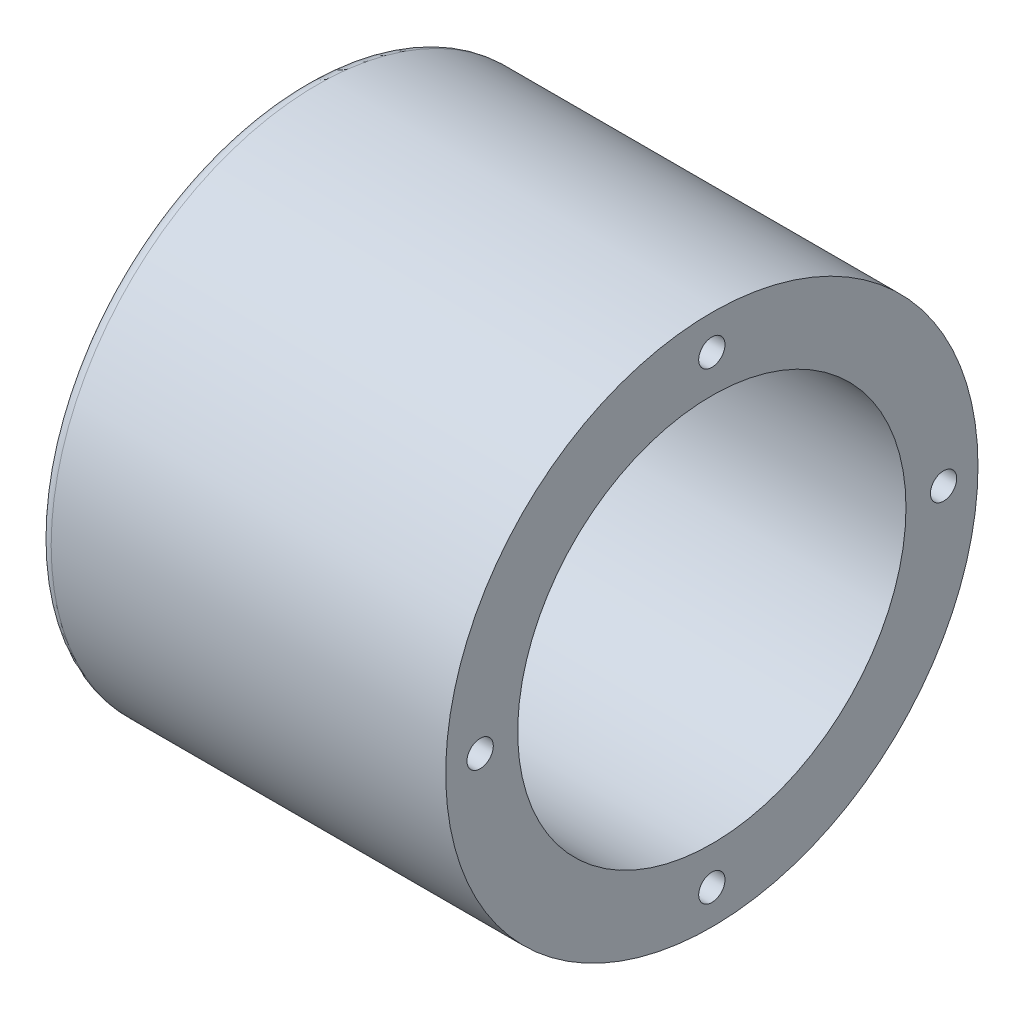
ISO-10303-21;
HEADER;
FILE_DESCRIPTION(('STEP AP214'),'2;1');
FILE_NAME('part.step','',(''),(''),'','','');
FILE_SCHEMA(('AUTOMOTIVE_DESIGN { 1 0 10303 214 1 1 1 1 }'));
ENDSEC;
DATA;
#1=APPLICATION_CONTEXT('core data for automotive mechanical design processes');
#2=APPLICATION_PROTOCOL_DEFINITION('international standard','automotive_design',2000,#1);
#3=PRODUCT_CONTEXT('',#1,'mechanical');
#4=PRODUCT('Part','Part','',(#3));
#5=PRODUCT_RELATED_PRODUCT_CATEGORY('part','',(#4));
#6=PRODUCT_DEFINITION_FORMATION('','',#4);
#7=PRODUCT_DEFINITION_CONTEXT('part definition',#1,'design');
#8=PRODUCT_DEFINITION('design','',#6,#7);
#9=PRODUCT_DEFINITION_SHAPE('','',#8);
#10=(LENGTH_UNIT() NAMED_UNIT(*) SI_UNIT(.MILLI.,.METRE.));
#11=(NAMED_UNIT(*) PLANE_ANGLE_UNIT() SI_UNIT($,.RADIAN.));
#12=(NAMED_UNIT(*) SI_UNIT($,.STERADIAN.) SOLID_ANGLE_UNIT());
#13=UNCERTAINTY_MEASURE_WITH_UNIT(LENGTH_MEASURE(1.E-05),#10,'distance_accuracy_value','');
#14=(GEOMETRIC_REPRESENTATION_CONTEXT(3) GLOBAL_UNCERTAINTY_ASSIGNED_CONTEXT((#13)) GLOBAL_UNIT_ASSIGNED_CONTEXT((#10,
#11,#12)) REPRESENTATION_CONTEXT('',''));
#15=CARTESIAN_POINT('',(0.,0.,0.));
#16=DIRECTION('',(0.,0.,1.));
#17=DIRECTION('',(1.,0.,0.));
#18=AXIS2_PLACEMENT_3D('',#15,#16,#17);
#19=CARTESIAN_POINT('',(-32.5,42.5,0.));
#20=DIRECTION('',(-1.,0.,0.));
#21=DIRECTION('',(0.,0.,1.));
#22=AXIS2_PLACEMENT_3D('',#19,#20,#21);
#23=PLANE('',#22);
#24=CARTESIAN_POINT('',(-32.5,0.,0.));
#25=DIRECTION('',(-1.,0.,0.));
#26=DIRECTION('',(0.,0.,1.));
#27=AXIS2_PLACEMENT_3D('',#24,#25,#26);
#28=CIRCLE('',#27,29.5);
#29=CARTESIAN_POINT('',(-32.5,0.,29.5));
#30=VERTEX_POINT('',#29);
#31=EDGE_CURVE('E51',#30,#30,#28,.F.);
#32=ORIENTED_EDGE('',*,*,#31,.T.);
#33=EDGE_LOOP('',(#32));
#34=FACE_BOUND('',#33,.T.);
#35=CARTESIAN_POINT('',(-32.5,0.,0.));
#36=DIRECTION('',(-1.,0.,0.));
#37=DIRECTION('',(0.,0.,1.));
#38=AXIS2_PLACEMENT_3D('',#35,#36,#37);
#39=CIRCLE('',#38,40.5);
#40=CARTESIAN_POINT('',(-32.5,0.,40.5));
#41=VERTEX_POINT('',#40);
#42=EDGE_CURVE('E125',#41,#41,#39,.T.);
#43=ORIENTED_EDGE('',*,*,#42,.T.);
#44=EDGE_LOOP('',(#43));
#45=FACE_BOUND('',#44,.T.);
#46=ADVANCED_FACE('F41',(#34,#45),#23,.T.);
#47=CARTESIAN_POINT('',(88.99,0.,0.));
#48=DIRECTION('',(1.,0.,0.));
#49=DIRECTION('',(0.,0.,-1.));
#50=AXIS2_PLACEMENT_3D('',#47,#48,#49);
#51=CYLINDRICAL_SURFACE('',#50,28.5);
#52=CARTESIAN_POINT('',(-31.5,0.,0.));
#53=DIRECTION('',(-1.,0.,0.));
#54=DIRECTION('',(0.,0.,1.));
#55=AXIS2_PLACEMENT_3D('',#52,#53,#54);
#56=CIRCLE('',#55,28.5);
#57=CARTESIAN_POINT('',(-31.5,0.,28.5));
#58=VERTEX_POINT('',#57);
#59=EDGE_CURVE('E11',#58,#58,#56,.T.);
#60=ORIENTED_EDGE('',*,*,#59,.T.);
#61=EDGE_LOOP('',(#60));
#62=FACE_BOUND('',#61,.T.);
#63=CARTESIAN_POINT('',(-28.5,0.,0.));
#64=DIRECTION('',(1.,0.,0.));
#65=DIRECTION('',(0.,0.,-1.));
#66=AXIS2_PLACEMENT_3D('',#63,#64,#65);
#67=CIRCLE('',#66,28.5);
#68=CARTESIAN_POINT('',(-28.5,0.,-28.5));
#69=VERTEX_POINT('',#68);
#70=EDGE_CURVE('E117',#69,#69,#67,.T.);
#71=ORIENTED_EDGE('',*,*,#70,.T.);
#72=EDGE_LOOP('',(#71));
#73=FACE_BOUND('',#72,.T.);
#74=ADVANCED_FACE('F148',(#62,#73),#51,.F.);
#75=CARTESIAN_POINT('',(-28.5,31.,0.));
#76=DIRECTION('',(1.,0.,0.));
#77=DIRECTION('',(0.,0.,-1.));
#78=AXIS2_PLACEMENT_3D('',#75,#76,#77);
#79=PLANE('',#78);
#80=CARTESIAN_POINT('',(-28.5,0.,0.));
#81=DIRECTION('',(1.,0.,0.));
#82=DIRECTION('',(0.,0.,-1.));
#83=AXIS2_PLACEMENT_3D('',#80,#81,#82);
#84=CIRCLE('',#83,31.);
#85=CARTESIAN_POINT('',(-28.5,0.,-31.));
#86=VERTEX_POINT('',#85);
#87=EDGE_CURVE('E113',#86,#86,#84,.T.);
#88=ORIENTED_EDGE('',*,*,#87,.T.);
#89=EDGE_LOOP('',(#88));
#90=FACE_BOUND('',#89,.T.);
#91=ORIENTED_EDGE('',*,*,#70,.F.);
#92=EDGE_LOOP('',(#91));
#93=FACE_BOUND('',#92,.T.);
#94=ADVANCED_FACE('F153',(#90,#93),#79,.T.);
#95=CARTESIAN_POINT('',(88.99,0.,0.));
#96=DIRECTION('',(1.,0.,0.));
#97=DIRECTION('',(0.,0.,-1.));
#98=AXIS2_PLACEMENT_3D('',#95,#96,#97);
#99=CYLINDRICAL_SURFACE('',#98,31.);
#100=CARTESIAN_POINT('',(32.5,0.,0.));
#101=DIRECTION('',(1.,0.,0.));
#102=DIRECTION('',(0.,0.,-1.));
#103=AXIS2_PLACEMENT_3D('',#100,#101,#102);
#104=CIRCLE('',#103,31.);
#105=CARTESIAN_POINT('',(32.5,0.,-31.));
#106=VERTEX_POINT('',#105);
#107=EDGE_CURVE('E109',#106,#106,#104,.T.);
#108=ORIENTED_EDGE('',*,*,#107,.T.);
#109=EDGE_LOOP('',(#108));
#110=FACE_BOUND('',#109,.T.);
#111=ORIENTED_EDGE('',*,*,#87,.F.);
#112=EDGE_LOOP('',(#111));
#113=FACE_BOUND('',#112,.T.);
#114=ADVANCED_FACE('F159',(#110,#113),#99,.F.);
#115=CARTESIAN_POINT('',(32.5,42.5,0.));
#116=DIRECTION('',(1.,0.,0.));
#117=DIRECTION('',(0.,0.,-1.));
#118=AXIS2_PLACEMENT_3D('',#115,#116,#117);
#119=PLANE('',#118);
#120=CARTESIAN_POINT('',(32.5,3.87554428611588E-13,37.));
#121=DIRECTION('',(1.,0.,0.));
#122=DIRECTION('',(0.,0.,-1.));
#123=AXIS2_PLACEMENT_3D('',#120,#121,#122);
#124=CIRCLE('',#123,2.09999999999999);
#125=CARTESIAN_POINT('',(32.5,3.87554428611588E-13,34.9));
#126=VERTEX_POINT('',#125);
#127=EDGE_CURVE('E76',#126,#126,#124,.T.);
#128=ORIENTED_EDGE('',*,*,#127,.F.);
#129=EDGE_LOOP('',(#128));
#130=FACE_BOUND('',#129,.T.);
#131=CARTESIAN_POINT('',(32.5,-37.,0.));
#132=DIRECTION('',(1.,0.,0.));
#133=DIRECTION('',(0.,0.,-1.));
#134=AXIS2_PLACEMENT_3D('',#131,#132,#133);
#135=CIRCLE('',#134,2.09999999999999);
#136=CARTESIAN_POINT('',(32.5,-37.,-2.09999999999999));
#137=VERTEX_POINT('',#136);
#138=EDGE_CURVE('E75',#137,#137,#135,.T.);
#139=ORIENTED_EDGE('',*,*,#138,.F.);
#140=EDGE_LOOP('',(#139));
#141=FACE_BOUND('',#140,.T.);
#142=CARTESIAN_POINT('',(32.5,-1.29184809537196E-13,-37.));
#143=DIRECTION('',(1.,0.,0.));
#144=DIRECTION('',(0.,0.,-1.));
#145=AXIS2_PLACEMENT_3D('',#142,#143,#144);
#146=CIRCLE('',#145,2.09999999999999);
#147=CARTESIAN_POINT('',(32.5,-1.29184809537196E-13,-39.1));
#148=VERTEX_POINT('',#147);
#149=EDGE_CURVE('E89',#148,#148,#146,.T.);
#150=ORIENTED_EDGE('',*,*,#149,.F.);
#151=EDGE_LOOP('',(#150));
#152=FACE_BOUND('',#151,.T.);
#153=CARTESIAN_POINT('',(32.5,37.,0.));
#154=DIRECTION('',(1.,0.,0.));
#155=DIRECTION('',(0.,0.,-1.));
#156=AXIS2_PLACEMENT_3D('',#153,#154,#155);
#157=CIRCLE('',#156,2.09999999999999);
#158=CARTESIAN_POINT('',(32.5,37.,-2.09999999999999));
#159=VERTEX_POINT('',#158);
#160=EDGE_CURVE('E97',#159,#159,#157,.T.);
#161=ORIENTED_EDGE('',*,*,#160,.F.);
#162=EDGE_LOOP('',(#161));
#163=FACE_BOUND('',#162,.T.);
#164=CARTESIAN_POINT('',(32.5,0.,0.));
#165=DIRECTION('',(1.,0.,0.));
#166=DIRECTION('',(0.,0.,-1.));
#167=AXIS2_PLACEMENT_3D('',#164,#165,#166);
#168=CIRCLE('',#167,42.5);
#169=CARTESIAN_POINT('',(32.5,0.,-42.5));
#170=VERTEX_POINT('',#169);
#171=EDGE_CURVE('E105',#170,#170,#168,.T.);
#172=ORIENTED_EDGE('',*,*,#171,.T.);
#173=EDGE_LOOP('',(#172));
#174=FACE_BOUND('',#173,.T.);
#175=ORIENTED_EDGE('',*,*,#107,.F.);
#176=EDGE_LOOP('',(#175));
#177=FACE_BOUND('',#176,.T.);
#178=ADVANCED_FACE('F163',(#130,#141,#152,#163,#174,#177),#119,.T.);
#179=CARTESIAN_POINT('',(88.99,0.,0.));
#180=DIRECTION('',(1.,0.,0.));
#181=DIRECTION('',(0.,0.,-1.));
#182=AXIS2_PLACEMENT_3D('',#179,#180,#181);
#183=CYLINDRICAL_SURFACE('',#182,42.5);
#184=CARTESIAN_POINT('',(-30.5,0.,0.));
#185=DIRECTION('',(-1.,0.,0.));
#186=DIRECTION('',(0.,0.,1.));
#187=AXIS2_PLACEMENT_3D('',#184,#185,#186);
#188=CIRCLE('',#187,42.5);
#189=CARTESIAN_POINT('',(-30.5,0.,42.5));
#190=VERTEX_POINT('',#189);
#191=EDGE_CURVE('E121',#190,#190,#188,.F.);
#192=ORIENTED_EDGE('',*,*,#191,.T.);
#193=EDGE_LOOP('',(#192));
#194=FACE_BOUND('',#193,.T.);
#195=ORIENTED_EDGE('',*,*,#171,.F.);
#196=EDGE_LOOP('',(#195));
#197=FACE_BOUND('',#196,.T.);
#198=ADVANCED_FACE('F144',(#194,#197),#183,.T.);
#199=CARTESIAN_POINT('',(-30.5,0.,0.));
#200=DIRECTION('',(-1.,0.,0.));
#201=DIRECTION('',(0.,0.,1.));
#202=AXIS2_PLACEMENT_3D('',#199,#200,#201);
#203=TOROIDAL_SURFACE('',#202,40.5,2.);
#204=ORIENTED_EDGE('',*,*,#42,.F.);
#205=EDGE_LOOP('',(#204));
#206=FACE_BOUND('',#205,.T.);
#207=ORIENTED_EDGE('',*,*,#191,.F.);
#208=EDGE_LOOP('',(#207));
#209=FACE_BOUND('',#208,.T.);
#210=ADVANCED_FACE('F136',(#206,#209),#203,.T.);
#211=CARTESIAN_POINT('',(-32.5,0.,0.));
#212=DIRECTION('',(-1.,0.,0.));
#213=DIRECTION('',(0.,0.,1.));
#214=AXIS2_PLACEMENT_3D('',#211,#212,#213);
#215=CONICAL_SURFACE('',#214,29.5,0.785398163397447);
#216=ORIENTED_EDGE('',*,*,#59,.F.);
#217=EDGE_LOOP('',(#216));
#218=FACE_BOUND('',#217,.T.);
#219=ORIENTED_EDGE('',*,*,#31,.F.);
#220=EDGE_LOOP('',(#219));
#221=FACE_BOUND('',#220,.T.);
#222=ADVANCED_FACE('F44',(#218,#221),#215,.F.);
#223=CARTESIAN_POINT('',(12.5,37.,0.));
#224=DIRECTION('',(1.,0.,0.));
#225=DIRECTION('',(0.,0.,-1.));
#226=AXIS2_PLACEMENT_3D('',#223,#224,#225);
#227=CONICAL_SURFACE('',#226,2.1,1.02974425867665);
#228=CARTESIAN_POINT('',(11.2381927000421,37.,0.));
#229=VERTEX_POINT('',#228);
#230=VERTEX_LOOP('',#229);
#231=FACE_BOUND('',#230,.T.);
#232=CARTESIAN_POINT('',(12.5,37.,0.));
#233=DIRECTION('',(1.,0.,0.));
#234=DIRECTION('',(0.,0.,-1.));
#235=AXIS2_PLACEMENT_3D('',#232,#233,#234);
#236=CIRCLE('',#235,2.1);
#237=CARTESIAN_POINT('',(12.5,37.,-2.1));
#238=VERTEX_POINT('',#237);
#239=EDGE_CURVE('E101',#238,#238,#236,.T.);
#240=ORIENTED_EDGE('',*,*,#239,.T.);
#241=EDGE_LOOP('',(#240));
#242=FACE_BOUND('',#241,.T.);
#243=ADVANCED_FACE('F135',(#231,#242),#227,.F.);
#244=CARTESIAN_POINT('',(32.5,37.,0.));
#245=DIRECTION('',(1.,0.,0.));
#246=DIRECTION('',(0.,0.,-1.));
#247=AXIS2_PLACEMENT_3D('',#244,#245,#246);
#248=CYLINDRICAL_SURFACE('',#247,2.09999999999999);
#249=ORIENTED_EDGE('',*,*,#239,.F.);
#250=EDGE_LOOP('',(#249));
#251=FACE_BOUND('',#250,.T.);
#252=ORIENTED_EDGE('',*,*,#160,.T.);
#253=EDGE_LOOP('',(#252));
#254=FACE_BOUND('',#253,.T.);
#255=ADVANCED_FACE('F142',(#251,#254),#248,.F.);
#256=CARTESIAN_POINT('',(12.5,-1.29184809537196E-13,-37.));
#257=DIRECTION('',(1.,0.,0.));
#258=DIRECTION('',(0.,0.,-1.));
#259=AXIS2_PLACEMENT_3D('',#256,#257,#258);
#260=CONICAL_SURFACE('',#259,2.09999999999999,1.02974425867665);
#261=CARTESIAN_POINT('',(11.2381927000421,-1.34392450387992E-13,-37.));
#262=VERTEX_POINT('',#261);
#263=VERTEX_LOOP('',#262);
#264=FACE_BOUND('',#263,.T.);
#265=CARTESIAN_POINT('',(12.5,-1.29184809537196E-13,-37.));
#266=DIRECTION('',(1.,0.,0.));
#267=DIRECTION('',(0.,0.,-1.));
#268=AXIS2_PLACEMENT_3D('',#265,#266,#267);
#269=CIRCLE('',#268,2.09999999999999);
#270=CARTESIAN_POINT('',(12.5,-1.29184809537196E-13,-39.1));
#271=VERTEX_POINT('',#270);
#272=EDGE_CURVE('E93',#271,#271,#269,.T.);
#273=ORIENTED_EDGE('',*,*,#272,.T.);
#274=EDGE_LOOP('',(#273));
#275=FACE_BOUND('',#274,.T.);
#276=ADVANCED_FACE('F173',(#264,#275),#260,.F.);
#277=CARTESIAN_POINT('',(32.5,-1.29184809537196E-13,-37.));
#278=DIRECTION('',(1.,0.,0.));
#279=DIRECTION('',(0.,0.,-1.));
#280=AXIS2_PLACEMENT_3D('',#277,#278,#279);
#281=CYLINDRICAL_SURFACE('',#280,2.09999999999999);
#282=ORIENTED_EDGE('',*,*,#272,.F.);
#283=EDGE_LOOP('',(#282));
#284=FACE_BOUND('',#283,.T.);
#285=ORIENTED_EDGE('',*,*,#149,.T.);
#286=EDGE_LOOP('',(#285));
#287=FACE_BOUND('',#286,.T.);
#288=ADVANCED_FACE('F177',(#284,#287),#281,.F.);
#289=CARTESIAN_POINT('',(12.5,-37.,0.));
#290=DIRECTION('',(1.,0.,0.));
#291=DIRECTION('',(0.,0.,-1.));
#292=AXIS2_PLACEMENT_3D('',#289,#290,#291);
#293=CONICAL_SURFACE('',#292,2.1,1.02974425867665);
#294=CARTESIAN_POINT('',(11.2381927000421,-37.,0.));
#295=VERTEX_POINT('',#294);
#296=VERTEX_LOOP('',#295);
#297=FACE_BOUND('',#296,.T.);
#298=CARTESIAN_POINT('',(12.5,-37.,0.));
#299=DIRECTION('',(1.,0.,0.));
#300=DIRECTION('',(0.,0.,-1.));
#301=AXIS2_PLACEMENT_3D('',#298,#299,#300);
#302=CIRCLE('',#301,2.1);
#303=CARTESIAN_POINT('',(12.5,-37.,-2.1));
#304=VERTEX_POINT('',#303);
#305=EDGE_CURVE('E81',#304,#304,#302,.T.);
#306=ORIENTED_EDGE('',*,*,#305,.T.);
#307=EDGE_LOOP('',(#306));
#308=FACE_BOUND('',#307,.T.);
#309=ADVANCED_FACE('F180',(#297,#308),#293,.F.);
#310=CARTESIAN_POINT('',(32.5,-37.,0.));
#311=DIRECTION('',(1.,0.,0.));
#312=DIRECTION('',(0.,0.,-1.));
#313=AXIS2_PLACEMENT_3D('',#310,#311,#312);
#314=CYLINDRICAL_SURFACE('',#313,2.09999999999999);
#315=ORIENTED_EDGE('',*,*,#305,.F.);
#316=EDGE_LOOP('',(#315));
#317=FACE_BOUND('',#316,.T.);
#318=ORIENTED_EDGE('',*,*,#138,.T.);
#319=EDGE_LOOP('',(#318));
#320=FACE_BOUND('',#319,.T.);
#321=ADVANCED_FACE('F68',(#317,#320),#314,.F.);
#322=CARTESIAN_POINT('',(12.5,3.87554428611588E-13,37.));
#323=DIRECTION('',(1.,0.,0.));
#324=DIRECTION('',(0.,0.,-1.));
#325=AXIS2_PLACEMENT_3D('',#322,#323,#324);
#326=CONICAL_SURFACE('',#325,2.09999999999999,1.02974425867665);
#327=CARTESIAN_POINT('',(11.2381927000421,3.82346787760792E-13,37.));
#328=VERTEX_POINT('',#327);
#329=VERTEX_LOOP('',#328);
#330=FACE_BOUND('',#329,.T.);
#331=CARTESIAN_POINT('',(12.5,3.87554428611588E-13,37.));
#332=DIRECTION('',(1.,0.,0.));
#333=DIRECTION('',(0.,0.,-1.));
#334=AXIS2_PLACEMENT_3D('',#331,#332,#333);
#335=CIRCLE('',#334,2.09999999999999);
#336=CARTESIAN_POINT('',(12.5,3.87554428611588E-13,34.9));
#337=VERTEX_POINT('',#336);
#338=EDGE_CURVE('E72',#337,#337,#335,.T.);
#339=ORIENTED_EDGE('',*,*,#338,.T.);
#340=EDGE_LOOP('',(#339));
#341=FACE_BOUND('',#340,.T.);
#342=ADVANCED_FACE('F64',(#330,#341),#326,.F.);
#343=CARTESIAN_POINT('',(32.5,3.87554428611588E-13,37.));
#344=DIRECTION('',(1.,0.,0.));
#345=DIRECTION('',(0.,0.,-1.));
#346=AXIS2_PLACEMENT_3D('',#343,#344,#345);
#347=CYLINDRICAL_SURFACE('',#346,2.09999999999999);
#348=ORIENTED_EDGE('',*,*,#338,.F.);
#349=EDGE_LOOP('',(#348));
#350=FACE_BOUND('',#349,.T.);
#351=ORIENTED_EDGE('',*,*,#127,.T.);
#352=EDGE_LOOP('',(#351));
#353=FACE_BOUND('',#352,.T.);
#354=ADVANCED_FACE('F67',(#350,#353),#347,.F.);
#355=CLOSED_SHELL('',(#46,#74,#94,#114,#178,#198,#210,#222,#243,#255,#276,#288,#309,#321,#342,#354));
#356=MANIFOLD_SOLID_BREP('B2',#355);
#357=ADVANCED_BREP_SHAPE_REPRESENTATION('',(#18,#356),#14);
#358=SHAPE_DEFINITION_REPRESENTATION(#9,#357);
ENDSEC;
END-ISO-10303-21;
